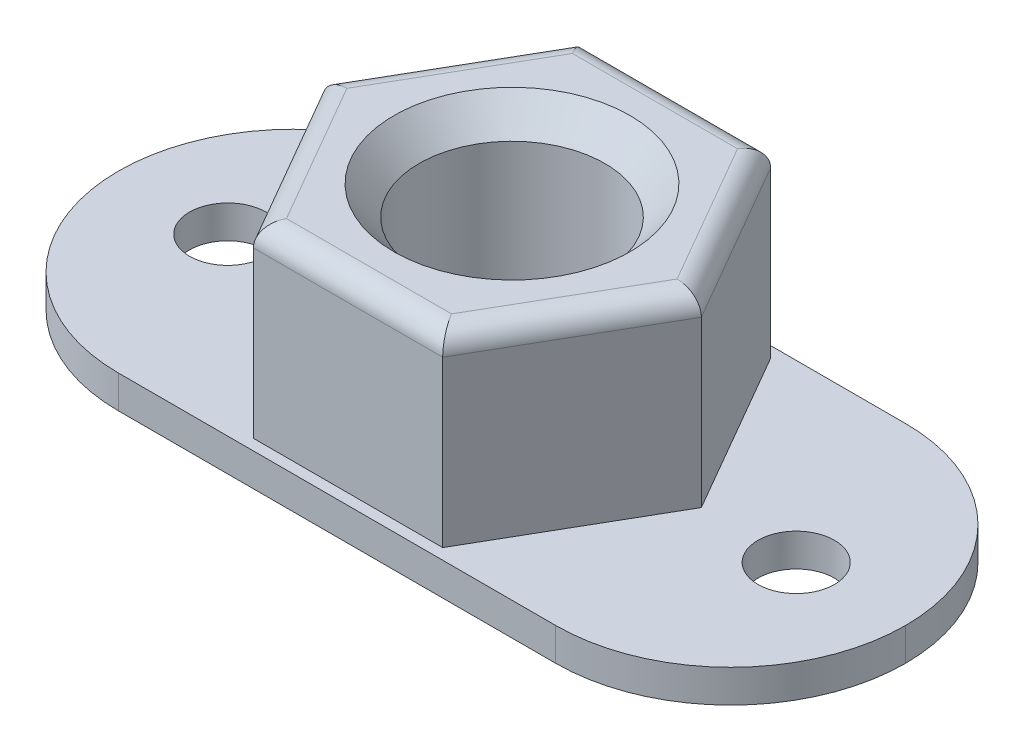
ISO-10303-21;
HEADER;
FILE_DESCRIPTION(('STEP AP214'),'2;1');
FILE_NAME('part.step','',(''),(''),'','','');
FILE_SCHEMA(('AUTOMOTIVE_DESIGN { 1 0 10303 214 1 1 1 1 }'));
ENDSEC;
DATA;
#1=APPLICATION_CONTEXT('core data for automotive mechanical design processes');
#2=APPLICATION_PROTOCOL_DEFINITION('international standard','automotive_design',2000,#1);
#3=PRODUCT_CONTEXT('',#1,'mechanical');
#4=PRODUCT('Part','Part','',(#3));
#5=PRODUCT_RELATED_PRODUCT_CATEGORY('part','',(#4));
#6=PRODUCT_DEFINITION_FORMATION('','',#4);
#7=PRODUCT_DEFINITION_CONTEXT('part definition',#1,'design');
#8=PRODUCT_DEFINITION('design','',#6,#7);
#9=PRODUCT_DEFINITION_SHAPE('','',#8);
#10=(LENGTH_UNIT() NAMED_UNIT(*) SI_UNIT(.MILLI.,.METRE.));
#11=(NAMED_UNIT(*) PLANE_ANGLE_UNIT() SI_UNIT($,.RADIAN.));
#12=(NAMED_UNIT(*) SI_UNIT($,.STERADIAN.) SOLID_ANGLE_UNIT());
#13=UNCERTAINTY_MEASURE_WITH_UNIT(LENGTH_MEASURE(1.E-05),#10,'distance_accuracy_value','');
#14=(GEOMETRIC_REPRESENTATION_CONTEXT(3) GLOBAL_UNCERTAINTY_ASSIGNED_CONTEXT((#13)) GLOBAL_UNIT_ASSIGNED_CONTEXT((#10,
#11,#12)) REPRESENTATION_CONTEXT('',''));
#15=CARTESIAN_POINT('',(0.,0.,0.));
#16=DIRECTION('',(0.,0.,1.));
#17=DIRECTION('',(1.,0.,0.));
#18=AXIS2_PLACEMENT_3D('',#15,#16,#17);
#19=CARTESIAN_POINT('',(6.87407664253899,13.49375,11.90625));
#20=DIRECTION('',(-0.866025403784438,0.,-0.5));
#21=DIRECTION('',(-0.5,0.,0.866025403784439));
#22=AXIS2_PLACEMENT_3D('',#19,#20,#21);
#23=PLANE('',#22);
#24=DIRECTION('',(0.,-1.,0.));
#25=VECTOR('',#24,1.);
#26=CARTESIAN_POINT('',(13.748153285078,13.49375,0.));
#27=LINE('',#26,#25);
#28=CARTESIAN_POINT('',(13.748153285078,11.96975,0.));
#29=VERTEX_POINT('',#28);
#30=CARTESIAN_POINT('',(13.748153285078,0.,0.));
#31=VERTEX_POINT('',#30);
#32=EDGE_CURVE('E164',#29,#31,#27,.T.);
#33=ORIENTED_EDGE('',*,*,#32,.F.);
#34=DIRECTION('',(0.5,0.,-0.866025403784439));
#35=VECTOR('',#34,1.);
#36=CARTESIAN_POINT('',(6.87407664253899,11.96975,11.90625));
#37=LINE('',#36,#35);
#38=CARTESIAN_POINT('',(6.87407664253899,11.96975,11.90625));
#39=VERTEX_POINT('',#38);
#40=EDGE_CURVE('E220',#29,#39,#37,.F.);
#41=ORIENTED_EDGE('',*,*,#40,.T.);
#42=DIRECTION('',(0.,-1.,0.));
#43=VECTOR('',#42,1.);
#44=CARTESIAN_POINT('',(6.87407664253899,13.49375,11.90625));
#45=LINE('',#44,#43);
#46=CARTESIAN_POINT('',(6.87407664253899,0.,11.90625));
#47=VERTEX_POINT('',#46);
#48=EDGE_CURVE('E174',#39,#47,#45,.T.);
#49=ORIENTED_EDGE('',*,*,#48,.T.);
#50=DIRECTION('',(0.5,0.,-0.866025403784438));
#51=VECTOR('',#50,1.);
#52=CARTESIAN_POINT('',(6.87407664253899,0.,11.90625));
#53=LINE('',#52,#51);
#54=EDGE_CURVE('E155',#47,#31,#53,.T.);
#55=ORIENTED_EDGE('',*,*,#54,.T.);
#56=EDGE_LOOP('',(#33,#41,#49,#55));
#57=FACE_BOUND('',#56,.T.);
#58=ADVANCED_FACE('F43',(#57),#23,.F.);
#59=CARTESIAN_POINT('',(13.748153285078,13.49375,0.));
#60=DIRECTION('',(-0.866025403784438,0.,0.5));
#61=DIRECTION('',(0.5,0.,0.866025403784439));
#62=AXIS2_PLACEMENT_3D('',#59,#60,#61);
#63=PLANE('',#62);
#64=DIRECTION('',(0.,-1.,0.));
#65=VECTOR('',#64,1.);
#66=CARTESIAN_POINT('',(6.87407664253898,13.49375,-11.90625));
#67=LINE('',#66,#65);
#68=CARTESIAN_POINT('',(6.87407664253898,11.96975,-11.90625));
#69=VERTEX_POINT('',#68);
#70=CARTESIAN_POINT('',(6.87407664253898,0.,-11.90625));
#71=VERTEX_POINT('',#70);
#72=EDGE_CURVE('E171',#69,#71,#67,.T.);
#73=ORIENTED_EDGE('',*,*,#72,.F.);
#74=DIRECTION('',(-0.5,0.,-0.866025403784439));
#75=VECTOR('',#74,1.);
#76=CARTESIAN_POINT('',(13.748153285078,11.96975,0.));
#77=LINE('',#76,#75);
#78=EDGE_CURVE('E167',#69,#29,#77,.F.);
#79=ORIENTED_EDGE('',*,*,#78,.T.);
#80=ORIENTED_EDGE('',*,*,#32,.T.);
#81=DIRECTION('',(-0.5,0.,-0.866025403784439));
#82=VECTOR('',#81,1.);
#83=CARTESIAN_POINT('',(13.748153285078,0.,0.));
#84=LINE('',#83,#82);
#85=EDGE_CURVE('E151',#31,#71,#84,.T.);
#86=ORIENTED_EDGE('',*,*,#85,.T.);
#87=EDGE_LOOP('',(#73,#79,#80,#86));
#88=FACE_BOUND('',#87,.T.);
#89=ADVANCED_FACE('F165',(#88),#63,.F.);
#90=CARTESIAN_POINT('',(6.87407664253898,13.49375,-11.90625));
#91=DIRECTION('',(0.,0.,1.));
#92=DIRECTION('',(1.,0.,0.));
#93=AXIS2_PLACEMENT_3D('',#90,#91,#92);
#94=PLANE('',#93);
#95=DIRECTION('',(0.,-1.,0.));
#96=VECTOR('',#95,1.);
#97=CARTESIAN_POINT('',(-6.87407664253898,13.49375,-11.90625));
#98=LINE('',#97,#96);
#99=CARTESIAN_POINT('',(-6.87407664253898,11.96975,-11.90625));
#100=VERTEX_POINT('',#99);
#101=CARTESIAN_POINT('',(-6.87407664253898,0.,-11.90625));
#102=VERTEX_POINT('',#101);
#103=EDGE_CURVE('E200',#100,#102,#98,.T.);
#104=ORIENTED_EDGE('',*,*,#103,.F.);
#105=DIRECTION('',(-1.,0.,0.));
#106=VECTOR('',#105,1.);
#107=CARTESIAN_POINT('',(6.87407664253898,11.96975,-11.90625));
#108=LINE('',#107,#106);
#109=EDGE_CURVE('E216',#100,#69,#108,.F.);
#110=ORIENTED_EDGE('',*,*,#109,.T.);
#111=ORIENTED_EDGE('',*,*,#72,.T.);
#112=DIRECTION('',(-1.,0.,0.));
#113=VECTOR('',#112,1.);
#114=CARTESIAN_POINT('',(6.87407664253898,0.,-11.90625));
#115=LINE('',#114,#113);
#116=EDGE_CURVE('E158',#71,#102,#115,.T.);
#117=ORIENTED_EDGE('',*,*,#116,.T.);
#118=EDGE_LOOP('',(#104,#110,#111,#117));
#119=FACE_BOUND('',#118,.T.);
#120=ADVANCED_FACE('F329',(#119),#94,.F.);
#121=CARTESIAN_POINT('',(-6.87407664253898,13.49375,-11.90625));
#122=DIRECTION('',(0.866025403784439,0.,0.5));
#123=DIRECTION('',(0.5,0.,-0.866025403784439));
#124=AXIS2_PLACEMENT_3D('',#121,#122,#123);
#125=PLANE('',#124);
#126=DIRECTION('',(0.,-1.,0.));
#127=VECTOR('',#126,1.);
#128=CARTESIAN_POINT('',(-13.748153285078,13.49375,0.));
#129=LINE('',#128,#127);
#130=CARTESIAN_POINT('',(-13.748153285078,11.96975,0.));
#131=VERTEX_POINT('',#130);
#132=CARTESIAN_POINT('',(-13.748153285078,0.,0.));
#133=VERTEX_POINT('',#132);
#134=EDGE_CURVE('E197',#131,#133,#129,.T.);
#135=ORIENTED_EDGE('',*,*,#134,.F.);
#136=DIRECTION('',(-0.5,0.,0.866025403784439));
#137=VECTOR('',#136,1.);
#138=CARTESIAN_POINT('',(-6.87407664253898,11.96975,-11.90625));
#139=LINE('',#138,#137);
#140=EDGE_CURVE('E226',#131,#100,#139,.F.);
#141=ORIENTED_EDGE('',*,*,#140,.T.);
#142=ORIENTED_EDGE('',*,*,#103,.T.);
#143=DIRECTION('',(-0.5,0.,0.866025403784439));
#144=VECTOR('',#143,1.);
#145=CARTESIAN_POINT('',(-6.87407664253898,0.,-11.90625));
#146=LINE('',#145,#144);
#147=EDGE_CURVE('E185',#102,#133,#146,.T.);
#148=ORIENTED_EDGE('',*,*,#147,.T.);
#149=EDGE_LOOP('',(#135,#141,#142,#148));
#150=FACE_BOUND('',#149,.T.);
#151=ADVANCED_FACE('F430',(#150),#125,.F.);
#152=CARTESIAN_POINT('',(-13.748153285078,13.49375,0.));
#153=DIRECTION('',(0.866025403784438,0.,-0.5));
#154=DIRECTION('',(-0.5,0.,-0.866025403784438));
#155=AXIS2_PLACEMENT_3D('',#152,#153,#154);
#156=PLANE('',#155);
#157=DIRECTION('',(0.,-1.,0.));
#158=VECTOR('',#157,1.);
#159=CARTESIAN_POINT('',(-6.87407664253898,13.49375,11.90625));
#160=LINE('',#159,#158);
#161=CARTESIAN_POINT('',(-6.87407664253898,11.96975,11.90625));
#162=VERTEX_POINT('',#161);
#163=CARTESIAN_POINT('',(-6.87407664253898,0.,11.90625));
#164=VERTEX_POINT('',#163);
#165=EDGE_CURVE('E194',#162,#164,#160,.T.);
#166=ORIENTED_EDGE('',*,*,#165,.F.);
#167=DIRECTION('',(0.5,0.,0.866025403784438));
#168=VECTOR('',#167,1.);
#169=CARTESIAN_POINT('',(-13.748153285078,11.96975,0.));
#170=LINE('',#169,#168);
#171=EDGE_CURVE('E224',#162,#131,#170,.F.);
#172=ORIENTED_EDGE('',*,*,#171,.T.);
#173=ORIENTED_EDGE('',*,*,#134,.T.);
#174=DIRECTION('',(0.5,0.,0.866025403784438));
#175=VECTOR('',#174,1.);
#176=CARTESIAN_POINT('',(-13.748153285078,0.,0.));
#177=LINE('',#176,#175);
#178=EDGE_CURVE('E188',#133,#164,#177,.T.);
#179=ORIENTED_EDGE('',*,*,#178,.T.);
#180=EDGE_LOOP('',(#166,#172,#173,#179));
#181=FACE_BOUND('',#180,.T.);
#182=ADVANCED_FACE('F320',(#181),#156,.F.);
#183=CARTESIAN_POINT('',(-6.87407664253898,13.49375,11.90625));
#184=DIRECTION('',(0.,0.,-1.));
#185=DIRECTION('',(-1.,0.,0.));
#186=AXIS2_PLACEMENT_3D('',#183,#184,#185);
#187=PLANE('',#186);
#188=ORIENTED_EDGE('',*,*,#48,.F.);
#189=DIRECTION('',(1.,0.,0.));
#190=VECTOR('',#189,1.);
#191=CARTESIAN_POINT('',(-6.87407664253898,11.96975,11.90625));
#192=LINE('',#191,#190);
#193=EDGE_CURVE('E222',#39,#162,#192,.F.);
#194=ORIENTED_EDGE('',*,*,#193,.T.);
#195=ORIENTED_EDGE('',*,*,#165,.T.);
#196=DIRECTION('',(1.,0.,0.));
#197=VECTOR('',#196,1.);
#198=CARTESIAN_POINT('',(-6.87407664253898,0.,11.90625));
#199=LINE('',#198,#197);
#200=EDGE_CURVE('E191',#164,#47,#199,.T.);
#201=ORIENTED_EDGE('',*,*,#200,.T.);
#202=EDGE_LOOP('',(#188,#194,#195,#201));
#203=FACE_BOUND('',#202,.T.);
#204=ADVANCED_FACE('F309',(#203),#187,.F.);
#205=CARTESIAN_POINT('',(0.,13.49375,0.));
#206=DIRECTION('',(0.,1.,0.));
#207=DIRECTION('',(0.,0.,1.));
#208=AXIS2_PLACEMENT_3D('',#205,#206,#207);
#209=PLANE('',#208);
#210=DIRECTION('',(-0.5,0.,-0.866025403784439));
#211=VECTOR('',#210,1.);
#212=CARTESIAN_POINT('',(5.5542539271715,13.49375,-11.14425));
#213=LINE('',#212,#211);
#214=CARTESIAN_POINT('',(11.988389664588,13.49375,0.));
#215=VERTEX_POINT('',#214);
#216=CARTESIAN_POINT('',(5.99419483229399,13.49375,-10.38225));
#217=VERTEX_POINT('',#216);
#218=EDGE_CURVE('E211',#215,#217,#213,.T.);
#219=ORIENTED_EDGE('',*,*,#218,.T.);
#220=DIRECTION('',(-1.,0.,0.));
#221=VECTOR('',#220,1.);
#222=CARTESIAN_POINT('',(-6.87407664253898,13.49375,-10.38225));
#223=LINE('',#222,#221);
#224=CARTESIAN_POINT('',(-5.99419483229399,13.49375,-10.38225));
#225=VERTEX_POINT('',#224);
#226=EDGE_CURVE('E213',#217,#225,#223,.T.);
#227=ORIENTED_EDGE('',*,*,#226,.T.);
#228=DIRECTION('',(-0.5,0.,0.866025403784439));
#229=VECTOR('',#228,1.);
#230=CARTESIAN_POINT('',(-12.4283305697105,13.49375,0.761999999999997));
#231=LINE('',#230,#229);
#232=CARTESIAN_POINT('',(-11.988389664588,13.49375,0.));
#233=VERTEX_POINT('',#232);
#234=EDGE_CURVE('E170',#225,#233,#231,.T.);
#235=ORIENTED_EDGE('',*,*,#234,.T.);
#236=DIRECTION('',(0.5,0.,0.866025403784438));
#237=VECTOR('',#236,1.);
#238=CARTESIAN_POINT('',(-5.55425392717149,13.49375,11.14425));
#239=LINE('',#238,#237);
#240=CARTESIAN_POINT('',(-5.99419483229399,13.49375,10.38225));
#241=VERTEX_POINT('',#240);
#242=EDGE_CURVE('E205',#233,#241,#239,.T.);
#243=ORIENTED_EDGE('',*,*,#242,.T.);
#244=DIRECTION('',(1.,0.,0.));
#245=VECTOR('',#244,1.);
#246=CARTESIAN_POINT('',(6.87407664253899,13.49375,10.38225));
#247=LINE('',#246,#245);
#248=CARTESIAN_POINT('',(5.994194832294,13.49375,10.38225));
#249=VERTEX_POINT('',#248);
#250=EDGE_CURVE('E207',#241,#249,#247,.T.);
#251=ORIENTED_EDGE('',*,*,#250,.T.);
#252=DIRECTION('',(0.5,0.,-0.866025403784439));
#253=VECTOR('',#252,1.);
#254=CARTESIAN_POINT('',(12.4283305697105,13.49375,-0.761999999999999));
#255=LINE('',#254,#253);
#256=EDGE_CURVE('E209',#249,#215,#255,.T.);
#257=ORIENTED_EDGE('',*,*,#256,.T.);
#258=EDGE_LOOP('',(#219,#227,#235,#243,#251,#257));
#259=FACE_BOUND('',#258,.T.);
#260=CARTESIAN_POINT('',(0.,13.49375,0.));
#261=DIRECTION('',(0.,1.,0.));
#262=DIRECTION('',(0.,0.,1.));
#263=AXIS2_PLACEMENT_3D('',#260,#261,#262);
#264=CIRCLE('',#263,8.5725);
#265=CARTESIAN_POINT('',(0.,13.49375,8.5725));
#266=VERTEX_POINT('',#265);
#267=EDGE_CURVE('E179',#266,#266,#264,.T.);
#268=ORIENTED_EDGE('',*,*,#267,.F.);
#269=EDGE_LOOP('',(#268));
#270=FACE_BOUND('',#269,.T.);
#271=ADVANCED_FACE('F306',(#259,#270),#209,.T.);
#272=CARTESIAN_POINT('',(0.,13.49375,0.));
#273=DIRECTION('',(0.,1.,0.));
#274=DIRECTION('',(0.,0.,1.));
#275=AXIS2_PLACEMENT_3D('',#272,#273,#274);
#276=CYLINDRICAL_SURFACE('',#275,6.74624);
#277=CARTESIAN_POINT('',(0.,0.,0.));
#278=DIRECTION('',(0.,1.,0.));
#279=DIRECTION('',(0.,0.,1.));
#280=AXIS2_PLACEMENT_3D('',#277,#278,#279);
#281=CIRCLE('',#280,6.74623999999999);
#282=CARTESIAN_POINT('',(0.,0.,6.74623999999999));
#283=VERTEX_POINT('',#282);
#284=EDGE_CURVE('E182',#283,#283,#281,.T.);
#285=ORIENTED_EDGE('',*,*,#284,.F.);
#286=EDGE_LOOP('',(#285));
#287=FACE_BOUND('',#286,.T.);
#288=CARTESIAN_POINT('',(0.,11.3928781926286,0.));
#289=DIRECTION('',(0.,1.,0.));
#290=DIRECTION('',(0.,0.,1.));
#291=AXIS2_PLACEMENT_3D('',#288,#289,#290);
#292=CIRCLE('',#291,6.74624);
#293=CARTESIAN_POINT('',(0.,11.3928781926286,6.74624));
#294=VERTEX_POINT('',#293);
#295=EDGE_CURVE('E176',#294,#294,#292,.T.);
#296=ORIENTED_EDGE('',*,*,#295,.T.);
#297=EDGE_LOOP('',(#296));
#298=FACE_BOUND('',#297,.T.);
#299=ADVANCED_FACE('F308',(#287,#298),#276,.F.);
#300=CARTESIAN_POINT('',(0.,13.49375,0.));
#301=DIRECTION('',(0.,1.,0.));
#302=DIRECTION('',(0.,0.,1.));
#303=AXIS2_PLACEMENT_3D('',#300,#301,#302);
#304=CONICAL_SURFACE('',#303,8.5725,0.715584993317675);
#305=ORIENTED_EDGE('',*,*,#295,.F.);
#306=EDGE_LOOP('',(#305));
#307=FACE_BOUND('',#306,.T.);
#308=ORIENTED_EDGE('',*,*,#267,.T.);
#309=EDGE_LOOP('',(#308));
#310=FACE_BOUND('',#309,.T.);
#311=ADVANCED_FACE('F304',(#307,#310),#304,.F.);
#312=CARTESIAN_POINT('',(0.,11.96975,10.38225));
#313=DIRECTION('',(-1.,0.,0.));
#314=DIRECTION('',(0.,0.,1.));
#315=AXIS2_PLACEMENT_3D('',#312,#313,#314);
#316=CYLINDRICAL_SURFACE('',#315,1.524);
#317=CARTESIAN_POINT('',(-5.99419483229399,11.96975,10.38225));
#318=DIRECTION('',(-0.866025403784439,0.,-0.5));
#319=DIRECTION('',(0.5,0.,-0.866025403784439));
#320=AXIS2_PLACEMENT_3D('',#317,#318,#319);
#321=ELLIPSE('',#320,1.75976362048998,1.524);
#322=EDGE_CURVE('E240',#162,#241,#321,.T.);
#323=ORIENTED_EDGE('',*,*,#322,.F.);
#324=ORIENTED_EDGE('',*,*,#193,.F.);
#325=CARTESIAN_POINT('',(5.994194832294,11.96975,10.38225));
#326=DIRECTION('',(-0.866025403784439,0.,0.5));
#327=DIRECTION('',(-0.5,0.,-0.866025403784439));
#328=AXIS2_PLACEMENT_3D('',#325,#326,#327);
#329=ELLIPSE('',#328,1.75976362048998,1.524);
#330=EDGE_CURVE('E243',#249,#39,#329,.F.);
#331=ORIENTED_EDGE('',*,*,#330,.F.);
#332=ORIENTED_EDGE('',*,*,#250,.F.);
#333=EDGE_LOOP('',(#323,#324,#331,#332));
#334=FACE_BOUND('',#333,.T.);
#335=ADVANCED_FACE('F352',(#334),#316,.T.);
#336=CARTESIAN_POINT('',(8.99129224844099,11.96975,5.191125));
#337=DIRECTION('',(-0.5,0.,0.866025403784439));
#338=DIRECTION('',(0.866025403784439,0.,0.5));
#339=AXIS2_PLACEMENT_3D('',#336,#337,#338);
#340=CYLINDRICAL_SURFACE('',#339,1.524);
#341=ORIENTED_EDGE('',*,*,#330,.T.);
#342=ORIENTED_EDGE('',*,*,#40,.F.);
#343=CARTESIAN_POINT('',(11.988389664588,11.96975,0.));
#344=DIRECTION('',(0.,0.,1.));
#345=DIRECTION('',(-1.,0.,0.));
#346=AXIS2_PLACEMENT_3D('',#343,#344,#345);
#347=ELLIPSE('',#346,1.75976362048998,1.524);
#348=EDGE_CURVE('E237',#215,#29,#347,.F.);
#349=ORIENTED_EDGE('',*,*,#348,.F.);
#350=ORIENTED_EDGE('',*,*,#256,.F.);
#351=EDGE_LOOP('',(#341,#342,#349,#350));
#352=FACE_BOUND('',#351,.T.);
#353=ADVANCED_FACE('F348',(#352),#340,.T.);
#354=CARTESIAN_POINT('',(-8.99129224844098,11.96975,5.191125));
#355=DIRECTION('',(-0.5,0.,-0.866025403784438));
#356=DIRECTION('',(-0.866025403784438,0.,0.5));
#357=AXIS2_PLACEMENT_3D('',#354,#355,#356);
#358=CYLINDRICAL_SURFACE('',#357,1.524);
#359=ORIENTED_EDGE('',*,*,#322,.T.);
#360=ORIENTED_EDGE('',*,*,#242,.F.);
#361=CARTESIAN_POINT('',(-11.988389664588,11.96975,0.));
#362=DIRECTION('',(0.,0.,-1.));
#363=DIRECTION('',(1.,0.,0.));
#364=AXIS2_PLACEMENT_3D('',#361,#362,#363);
#365=ELLIPSE('',#364,1.75976362048998,1.524);
#366=EDGE_CURVE('E234',#131,#233,#365,.T.);
#367=ORIENTED_EDGE('',*,*,#366,.F.);
#368=ORIENTED_EDGE('',*,*,#171,.F.);
#369=EDGE_LOOP('',(#359,#360,#367,#368));
#370=FACE_BOUND('',#369,.T.);
#371=ADVANCED_FACE('F344',(#370),#358,.T.);
#372=CARTESIAN_POINT('',(8.99129224844099,11.96975,-5.191125));
#373=DIRECTION('',(0.5,0.,0.866025403784439));
#374=DIRECTION('',(0.866025403784438,0.,-0.5));
#375=AXIS2_PLACEMENT_3D('',#372,#373,#374);
#376=CYLINDRICAL_SURFACE('',#375,1.524);
#377=ORIENTED_EDGE('',*,*,#348,.T.);
#378=ORIENTED_EDGE('',*,*,#78,.F.);
#379=CARTESIAN_POINT('',(5.99419483229399,11.96975,-10.38225));
#380=DIRECTION('',(0.866025403784439,0.,0.5));
#381=DIRECTION('',(-0.5,0.,0.866025403784439));
#382=AXIS2_PLACEMENT_3D('',#379,#380,#381);
#383=ELLIPSE('',#382,1.75976362048998,1.524);
#384=EDGE_CURVE('E231',#217,#69,#383,.F.);
#385=ORIENTED_EDGE('',*,*,#384,.F.);
#386=ORIENTED_EDGE('',*,*,#218,.F.);
#387=EDGE_LOOP('',(#377,#378,#385,#386));
#388=FACE_BOUND('',#387,.T.);
#389=ADVANCED_FACE('F340',(#388),#376,.T.);
#390=CARTESIAN_POINT('',(-8.99129224844099,11.96975,-5.191125));
#391=DIRECTION('',(0.5,0.,-0.866025403784439));
#392=DIRECTION('',(-0.866025403784439,0.,-0.5));
#393=AXIS2_PLACEMENT_3D('',#390,#391,#392);
#394=CYLINDRICAL_SURFACE('',#393,1.524);
#395=ORIENTED_EDGE('',*,*,#366,.T.);
#396=ORIENTED_EDGE('',*,*,#234,.F.);
#397=CARTESIAN_POINT('',(-5.99419483229399,11.96975,-10.38225));
#398=DIRECTION('',(0.866025403784439,0.,-0.5));
#399=DIRECTION('',(-0.5,0.,-0.866025403784439));
#400=AXIS2_PLACEMENT_3D('',#397,#398,#399);
#401=ELLIPSE('',#400,1.75976362048998,1.524);
#402=EDGE_CURVE('E229',#100,#225,#401,.T.);
#403=ORIENTED_EDGE('',*,*,#402,.F.);
#404=ORIENTED_EDGE('',*,*,#140,.F.);
#405=EDGE_LOOP('',(#395,#396,#403,#404));
#406=FACE_BOUND('',#405,.T.);
#407=ADVANCED_FACE('F336',(#406),#394,.T.);
#408=CARTESIAN_POINT('',(0.,11.96975,-10.38225));
#409=DIRECTION('',(1.,0.,0.));
#410=DIRECTION('',(0.,0.,-1.));
#411=AXIS2_PLACEMENT_3D('',#408,#409,#410);
#412=CYLINDRICAL_SURFACE('',#411,1.524);
#413=ORIENTED_EDGE('',*,*,#384,.T.);
#414=ORIENTED_EDGE('',*,*,#109,.F.);
#415=ORIENTED_EDGE('',*,*,#402,.T.);
#416=ORIENTED_EDGE('',*,*,#226,.F.);
#417=EDGE_LOOP('',(#413,#414,#415,#416));
#418=FACE_BOUND('',#417,.T.);
#419=ADVANCED_FACE('F333',(#418),#412,.T.);
#420=CARTESIAN_POINT('',(0.,-2.38125,0.));
#421=DIRECTION('',(0.,1.,0.));
#422=DIRECTION('',(0.,0.,1.));
#423=AXIS2_PLACEMENT_3D('',#420,#421,#422);
#424=PLANE('',#423);
#425=CARTESIAN_POINT('',(-20.6375,-2.38125,0.));
#426=DIRECTION('',(0.,-1.,0.));
#427=DIRECTION('',(0.,0.,-1.));
#428=AXIS2_PLACEMENT_3D('',#425,#426,#427);
#429=CIRCLE('',#428,2.778125);
#430=CARTESIAN_POINT('',(-20.6375,-2.38125,-2.778125));
#431=VERTEX_POINT('',#430);
#432=EDGE_CURVE('E275',#431,#431,#429,.T.);
#433=ORIENTED_EDGE('',*,*,#432,.F.);
#434=EDGE_LOOP('',(#433));
#435=FACE_BOUND('',#434,.T.);
#436=CARTESIAN_POINT('',(20.6375,-2.38125,0.));
#437=DIRECTION('',(0.,-1.,0.));
#438=DIRECTION('',(0.,0.,-1.));
#439=AXIS2_PLACEMENT_3D('',#436,#437,#438);
#440=CIRCLE('',#439,2.778125);
#441=CARTESIAN_POINT('',(20.6375,-2.38125,-2.778125));
#442=VERTEX_POINT('',#441);
#443=EDGE_CURVE('E281',#442,#442,#440,.T.);
#444=ORIENTED_EDGE('',*,*,#443,.F.);
#445=EDGE_LOOP('',(#444));
#446=FACE_BOUND('',#445,.T.);
#447=CARTESIAN_POINT('',(0.,-2.38125,0.));
#448=DIRECTION('',(0.,-1.,0.));
#449=DIRECTION('',(0.,0.,-1.));
#450=AXIS2_PLACEMENT_3D('',#447,#448,#449);
#451=CIRCLE('',#450,9.525);
#452=CARTESIAN_POINT('',(0.,-2.38125,-9.525));
#453=VERTEX_POINT('',#452);
#454=EDGE_CURVE('E279',#453,#453,#451,.T.);
#455=ORIENTED_EDGE('',*,*,#454,.F.);
#456=EDGE_LOOP('',(#455));
#457=FACE_BOUND('',#456,.T.);
#458=CARTESIAN_POINT('',(-15.875,-2.38125,0.));
#459=DIRECTION('',(0.,1.,0.));
#460=DIRECTION('',(0.,0.,1.));
#461=AXIS2_PLACEMENT_3D('',#458,#459,#460);
#462=CIRCLE('',#461,12.7);
#463=CARTESIAN_POINT('',(-15.875,-2.38125,12.7));
#464=VERTEX_POINT('',#463);
#465=CARTESIAN_POINT('',(-28.575,-2.38125,0.));
#466=VERTEX_POINT('',#465);
#467=EDGE_CURVE('E60',#464,#466,#462,.F.);
#468=ORIENTED_EDGE('',*,*,#467,.T.);
#469=CARTESIAN_POINT('',(-15.875,-2.38125,0.));
#470=DIRECTION('',(0.,1.,0.));
#471=DIRECTION('',(0.,0.,1.));
#472=AXIS2_PLACEMENT_3D('',#469,#470,#471);
#473=CIRCLE('',#472,12.7);
#474=CARTESIAN_POINT('',(-15.875,-2.38125,-12.7));
#475=VERTEX_POINT('',#474);
#476=EDGE_CURVE('E264',#466,#475,#473,.F.);
#477=ORIENTED_EDGE('',*,*,#476,.T.);
#478=DIRECTION('',(1.,0.,0.));
#479=VECTOR('',#478,1.);
#480=CARTESIAN_POINT('',(-28.575,-2.38125,-12.7));
#481=LINE('',#480,#479);
#482=CARTESIAN_POINT('',(15.875,-2.38125,-12.7));
#483=VERTEX_POINT('',#482);
#484=EDGE_CURVE('E232',#475,#483,#481,.T.);
#485=ORIENTED_EDGE('',*,*,#484,.T.);
#486=CARTESIAN_POINT('',(15.875,-2.38125,0.));
#487=DIRECTION('',(0.,1.,0.));
#488=DIRECTION('',(0.,0.,1.));
#489=AXIS2_PLACEMENT_3D('',#486,#487,#488);
#490=CIRCLE('',#489,12.7);
#491=CARTESIAN_POINT('',(28.575,-2.38125,0.));
#492=VERTEX_POINT('',#491);
#493=EDGE_CURVE('E261',#483,#492,#490,.F.);
#494=ORIENTED_EDGE('',*,*,#493,.T.);
#495=CARTESIAN_POINT('',(15.875,-2.38125,0.));
#496=DIRECTION('',(0.,1.,0.));
#497=DIRECTION('',(0.,0.,1.));
#498=AXIS2_PLACEMENT_3D('',#495,#496,#497);
#499=CIRCLE('',#498,12.7);
#500=CARTESIAN_POINT('',(15.875,-2.38125,12.7));
#501=VERTEX_POINT('',#500);
#502=EDGE_CURVE('E259',#492,#501,#499,.F.);
#503=ORIENTED_EDGE('',*,*,#502,.T.);
#504=DIRECTION('',(-1.,0.,0.));
#505=VECTOR('',#504,1.);
#506=CARTESIAN_POINT('',(-28.575,-2.38125,12.7));
#507=LINE('',#506,#505);
#508=EDGE_CURVE('E293',#501,#464,#507,.T.);
#509=ORIENTED_EDGE('',*,*,#508,.T.);
#510=EDGE_LOOP('',(#468,#477,#485,#494,#503,#509));
#511=FACE_BOUND('',#510,.T.);
#512=ADVANCED_FACE('F335',(#435,#446,#457,#511),#424,.F.);
#513=CARTESIAN_POINT('',(-28.575,-2.38125,-12.7));
#514=DIRECTION('',(0.,0.,1.));
#515=DIRECTION('',(1.,0.,0.));
#516=AXIS2_PLACEMENT_3D('',#513,#514,#515);
#517=PLANE('',#516);
#518=ORIENTED_EDGE('',*,*,#484,.F.);
#519=DIRECTION('',(0.,1.,0.));
#520=VECTOR('',#519,1.);
#521=CARTESIAN_POINT('',(-15.875,-2.38125,-12.7));
#522=LINE('',#521,#520);
#523=CARTESIAN_POINT('',(-15.875,0.,-12.7));
#524=VERTEX_POINT('',#523);
#525=EDGE_CURVE('E248',#475,#524,#522,.T.);
#526=ORIENTED_EDGE('',*,*,#525,.T.);
#527=DIRECTION('',(1.,0.,0.));
#528=VECTOR('',#527,1.);
#529=CARTESIAN_POINT('',(-28.575,0.,-12.7));
#530=LINE('',#529,#528);
#531=CARTESIAN_POINT('',(15.875,0.,-12.7));
#532=VERTEX_POINT('',#531);
#533=EDGE_CURVE('E295',#524,#532,#530,.T.);
#534=ORIENTED_EDGE('',*,*,#533,.T.);
#535=DIRECTION('',(0.,1.,0.));
#536=VECTOR('',#535,1.);
#537=CARTESIAN_POINT('',(15.875,-2.38125,-12.7));
#538=LINE('',#537,#536);
#539=EDGE_CURVE('E228',#532,#483,#538,.F.);
#540=ORIENTED_EDGE('',*,*,#539,.T.);
#541=EDGE_LOOP('',(#518,#526,#534,#540));
#542=FACE_BOUND('',#541,.T.);
#543=ADVANCED_FACE('F381',(#542),#517,.F.);
#544=CARTESIAN_POINT('',(-28.575,-2.38125,12.7));
#545=DIRECTION('',(0.,0.,-1.));
#546=DIRECTION('',(-1.,0.,0.));
#547=AXIS2_PLACEMENT_3D('',#544,#545,#546);
#548=PLANE('',#547);
#549=DIRECTION('',(-1.,0.,0.));
#550=VECTOR('',#549,1.);
#551=CARTESIAN_POINT('',(-28.575,0.,12.7));
#552=LINE('',#551,#550);
#553=CARTESIAN_POINT('',(15.875,0.,12.7));
#554=VERTEX_POINT('',#553);
#555=CARTESIAN_POINT('',(-15.875,0.,12.7));
#556=VERTEX_POINT('',#555);
#557=EDGE_CURVE('E270',#554,#556,#552,.T.);
#558=ORIENTED_EDGE('',*,*,#557,.T.);
#559=DIRECTION('',(0.,1.,0.));
#560=VECTOR('',#559,1.);
#561=CARTESIAN_POINT('',(-15.875,-2.38125,12.7));
#562=LINE('',#561,#560);
#563=EDGE_CURVE('E11',#556,#464,#562,.F.);
#564=ORIENTED_EDGE('',*,*,#563,.T.);
#565=ORIENTED_EDGE('',*,*,#508,.F.);
#566=DIRECTION('',(0.,1.,0.));
#567=VECTOR('',#566,1.);
#568=CARTESIAN_POINT('',(15.875,-2.38125,12.7));
#569=LINE('',#568,#567);
#570=EDGE_CURVE('E52',#501,#554,#569,.T.);
#571=ORIENTED_EDGE('',*,*,#570,.T.);
#572=EDGE_LOOP('',(#558,#564,#565,#571));
#573=FACE_BOUND('',#572,.T.);
#574=ADVANCED_FACE('F390',(#573),#548,.F.);
#575=CARTESIAN_POINT('',(0.,0.,0.));
#576=DIRECTION('',(0.,1.,0.));
#577=DIRECTION('',(0.,0.,1.));
#578=AXIS2_PLACEMENT_3D('',#575,#576,#577);
#579=PLANE('',#578);
#580=CARTESIAN_POINT('',(-20.6375,0.,0.));
#581=DIRECTION('',(0.,1.,0.));
#582=DIRECTION('',(0.,0.,1.));
#583=AXIS2_PLACEMENT_3D('',#580,#581,#582);
#584=CIRCLE('',#583,2.778125);
#585=CARTESIAN_POINT('',(-20.6375,0.,2.778125));
#586=VERTEX_POINT('',#585);
#587=EDGE_CURVE('E47',#586,#586,#584,.T.);
#588=ORIENTED_EDGE('',*,*,#587,.F.);
#589=EDGE_LOOP('',(#588));
#590=FACE_BOUND('',#589,.T.);
#591=CARTESIAN_POINT('',(20.6375,0.,0.));
#592=DIRECTION('',(0.,1.,0.));
#593=DIRECTION('',(0.,0.,1.));
#594=AXIS2_PLACEMENT_3D('',#591,#592,#593);
#595=CIRCLE('',#594,2.778125);
#596=CARTESIAN_POINT('',(20.6375,0.,2.778125));
#597=VERTEX_POINT('',#596);
#598=EDGE_CURVE('E273',#597,#597,#595,.T.);
#599=ORIENTED_EDGE('',*,*,#598,.F.);
#600=EDGE_LOOP('',(#599));
#601=FACE_BOUND('',#600,.T.);
#602=ORIENTED_EDGE('',*,*,#533,.F.);
#603=CARTESIAN_POINT('',(-15.875,0.,0.));
#604=DIRECTION('',(0.,1.,0.));
#605=DIRECTION('',(0.,0.,1.));
#606=AXIS2_PLACEMENT_3D('',#603,#604,#605);
#607=CIRCLE('',#606,12.7);
#608=CARTESIAN_POINT('',(-28.575,0.,0.));
#609=VERTEX_POINT('',#608);
#610=EDGE_CURVE('E257',#524,#609,#607,.T.);
#611=ORIENTED_EDGE('',*,*,#610,.T.);
#612=CARTESIAN_POINT('',(-15.875,0.,0.));
#613=DIRECTION('',(0.,1.,0.));
#614=DIRECTION('',(0.,0.,1.));
#615=AXIS2_PLACEMENT_3D('',#612,#613,#614);
#616=CIRCLE('',#615,12.7);
#617=EDGE_CURVE('E255',#609,#556,#616,.T.);
#618=ORIENTED_EDGE('',*,*,#617,.T.);
#619=ORIENTED_EDGE('',*,*,#557,.F.);
#620=CARTESIAN_POINT('',(15.875,0.,0.));
#621=DIRECTION('',(0.,1.,0.));
#622=DIRECTION('',(0.,0.,1.));
#623=AXIS2_PLACEMENT_3D('',#620,#621,#622);
#624=CIRCLE('',#623,12.7);
#625=CARTESIAN_POINT('',(28.575,0.,0.));
#626=VERTEX_POINT('',#625);
#627=EDGE_CURVE('E251',#554,#626,#624,.T.);
#628=ORIENTED_EDGE('',*,*,#627,.T.);
#629=CARTESIAN_POINT('',(15.875,0.,0.));
#630=DIRECTION('',(0.,1.,0.));
#631=DIRECTION('',(0.,0.,1.));
#632=AXIS2_PLACEMENT_3D('',#629,#630,#631);
#633=CIRCLE('',#632,12.7);
#634=EDGE_CURVE('E253',#626,#532,#633,.T.);
#635=ORIENTED_EDGE('',*,*,#634,.T.);
#636=EDGE_LOOP('',(#602,#611,#618,#619,#628,#635));
#637=FACE_BOUND('',#636,.T.);
#638=ORIENTED_EDGE('',*,*,#54,.F.);
#639=ORIENTED_EDGE('',*,*,#200,.F.);
#640=ORIENTED_EDGE('',*,*,#178,.F.);
#641=ORIENTED_EDGE('',*,*,#147,.F.);
#642=ORIENTED_EDGE('',*,*,#116,.F.);
#643=ORIENTED_EDGE('',*,*,#85,.F.);
#644=EDGE_LOOP('',(#638,#639,#640,#641,#642,#643));
#645=FACE_BOUND('',#644,.T.);
#646=ADVANCED_FACE('F153',(#590,#601,#637,#645),#579,.T.);
#647=CARTESIAN_POINT('',(-15.875,-2.38125,0.));
#648=DIRECTION('',(0.,1.,0.));
#649=DIRECTION('',(0.,0.,1.));
#650=AXIS2_PLACEMENT_3D('',#647,#648,#649);
#651=CYLINDRICAL_SURFACE('',#650,12.7);
#652=DIRECTION('',(0.,1.,0.));
#653=VECTOR('',#652,1.);
#654=CARTESIAN_POINT('',(-28.575,-2.38125,0.));
#655=LINE('',#654,#653);
#656=EDGE_CURVE('E267',#466,#609,#655,.T.);
#657=ORIENTED_EDGE('',*,*,#656,.F.);
#658=ORIENTED_EDGE('',*,*,#467,.F.);
#659=ORIENTED_EDGE('',*,*,#563,.F.);
#660=ORIENTED_EDGE('',*,*,#617,.F.);
#661=EDGE_LOOP('',(#657,#658,#659,#660));
#662=FACE_BOUND('',#661,.T.);
#663=ADVANCED_FACE('F359',(#662),#651,.T.);
#664=CARTESIAN_POINT('',(-15.875,-2.38125,0.));
#665=DIRECTION('',(0.,1.,0.));
#666=DIRECTION('',(0.,0.,1.));
#667=AXIS2_PLACEMENT_3D('',#664,#665,#666);
#668=CYLINDRICAL_SURFACE('',#667,12.7);
#669=ORIENTED_EDGE('',*,*,#476,.F.);
#670=ORIENTED_EDGE('',*,*,#656,.T.);
#671=ORIENTED_EDGE('',*,*,#610,.F.);
#672=ORIENTED_EDGE('',*,*,#525,.F.);
#673=EDGE_LOOP('',(#669,#670,#671,#672));
#674=FACE_BOUND('',#673,.T.);
#675=ADVANCED_FACE('F356',(#674),#668,.T.);
#676=CARTESIAN_POINT('',(15.875,-2.38125,0.));
#677=DIRECTION('',(0.,1.,0.));
#678=DIRECTION('',(0.,0.,1.));
#679=AXIS2_PLACEMENT_3D('',#676,#677,#678);
#680=CYLINDRICAL_SURFACE('',#679,12.7);
#681=ORIENTED_EDGE('',*,*,#570,.F.);
#682=ORIENTED_EDGE('',*,*,#502,.F.);
#683=DIRECTION('',(0.,1.,0.));
#684=VECTOR('',#683,1.);
#685=CARTESIAN_POINT('',(28.575,-2.38125,0.));
#686=LINE('',#685,#684);
#687=EDGE_CURVE('E271',#626,#492,#686,.F.);
#688=ORIENTED_EDGE('',*,*,#687,.F.);
#689=ORIENTED_EDGE('',*,*,#627,.F.);
#690=EDGE_LOOP('',(#681,#682,#688,#689));
#691=FACE_BOUND('',#690,.T.);
#692=ADVANCED_FACE('F45',(#691),#680,.T.);
#693=CARTESIAN_POINT('',(15.875,-2.38125,0.));
#694=DIRECTION('',(0.,1.,0.));
#695=DIRECTION('',(0.,0.,1.));
#696=AXIS2_PLACEMENT_3D('',#693,#694,#695);
#697=CYLINDRICAL_SURFACE('',#696,12.7);
#698=ORIENTED_EDGE('',*,*,#493,.F.);
#699=ORIENTED_EDGE('',*,*,#539,.F.);
#700=ORIENTED_EDGE('',*,*,#634,.F.);
#701=ORIENTED_EDGE('',*,*,#687,.T.);
#702=EDGE_LOOP('',(#698,#699,#700,#701));
#703=FACE_BOUND('',#702,.T.);
#704=ADVANCED_FACE('F363',(#703),#697,.T.);
#705=CARTESIAN_POINT('',(0.,0.,0.));
#706=DIRECTION('',(0.,1.,0.));
#707=DIRECTION('',(0.,0.,1.));
#708=AXIS2_PLACEMENT_3D('',#705,#706,#707);
#709=PLANE('',#708);
#710=ORIENTED_EDGE('',*,*,#284,.T.);
#711=EDGE_LOOP('',(#710));
#712=FACE_BOUND('',#711,.T.);
#713=CARTESIAN_POINT('',(0.,0.,0.));
#714=DIRECTION('',(0.,1.,0.));
#715=DIRECTION('',(0.,0.,1.));
#716=AXIS2_PLACEMENT_3D('',#713,#714,#715);
#717=CIRCLE('',#716,9.525);
#718=CARTESIAN_POINT('',(0.,0.,9.525));
#719=VERTEX_POINT('',#718);
#720=EDGE_CURVE('E290',#719,#719,#717,.F.);
#721=ORIENTED_EDGE('',*,*,#720,.T.);
#722=EDGE_LOOP('',(#721));
#723=FACE_BOUND('',#722,.T.);
#724=ADVANCED_FACE('F365',(#712,#723),#709,.F.);
#725=CARTESIAN_POINT('',(0.,26.9407683632075,0.));
#726=DIRECTION('',(0.,-1.,0.));
#727=DIRECTION('',(0.,0.,-1.));
#728=AXIS2_PLACEMENT_3D('',#725,#726,#727);
#729=CYLINDRICAL_SURFACE('',#728,9.525);
#730=ORIENTED_EDGE('',*,*,#454,.T.);
#731=EDGE_LOOP('',(#730));
#732=FACE_BOUND('',#731,.T.);
#733=ORIENTED_EDGE('',*,*,#720,.F.);
#734=EDGE_LOOP('',(#733));
#735=FACE_BOUND('',#734,.T.);
#736=ADVANCED_FACE('F371',(#732,#735),#729,.F.);
#737=CARTESIAN_POINT('',(20.6375,13.49375,0.));
#738=DIRECTION('',(0.,-1.,0.));
#739=DIRECTION('',(0.,0.,-1.));
#740=AXIS2_PLACEMENT_3D('',#737,#738,#739);
#741=CYLINDRICAL_SURFACE('',#740,2.778125);
#742=ORIENTED_EDGE('',*,*,#598,.T.);
#743=EDGE_LOOP('',(#742));
#744=FACE_BOUND('',#743,.T.);
#745=ORIENTED_EDGE('',*,*,#443,.T.);
#746=EDGE_LOOP('',(#745));
#747=FACE_BOUND('',#746,.T.);
#748=ADVANCED_FACE('F510',(#744,#747),#741,.F.);
#749=CARTESIAN_POINT('',(-20.6375,13.49375,0.));
#750=DIRECTION('',(0.,-1.,0.));
#751=DIRECTION('',(0.,0.,-1.));
#752=AXIS2_PLACEMENT_3D('',#749,#750,#751);
#753=CYLINDRICAL_SURFACE('',#752,2.778125);
#754=ORIENTED_EDGE('',*,*,#587,.T.);
#755=EDGE_LOOP('',(#754));
#756=FACE_BOUND('',#755,.T.);
#757=ORIENTED_EDGE('',*,*,#432,.T.);
#758=EDGE_LOOP('',(#757));
#759=FACE_BOUND('',#758,.T.);
#760=ADVANCED_FACE('F517',(#756,#759),#753,.F.);
#761=CLOSED_SHELL('',(#58,#89,#120,#151,#182,#204,#271,#299,#311,#335,#353,#371,#389,#407,#419,
#512,#543,#574,#646,#663,#675,#692,#704,#724,#736,#748,#760));
#762=MANIFOLD_SOLID_BREP('B2',#761);
#763=ADVANCED_BREP_SHAPE_REPRESENTATION('',(#18,#762),#14);
#764=SHAPE_DEFINITION_REPRESENTATION(#9,#763);
ENDSEC;
END-ISO-10303-21;
